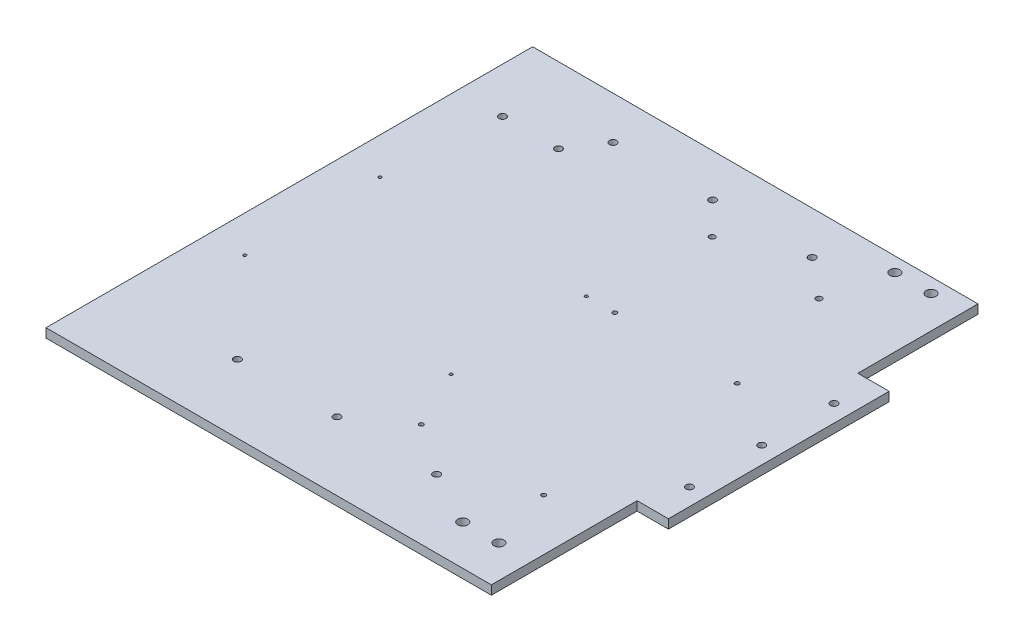
ISO-10303-21;
HEADER;
FILE_DESCRIPTION(('STEP AP214'),'2;1');
FILE_NAME('part.step','',(''),(''),'','','');
FILE_SCHEMA(('AUTOMOTIVE_DESIGN { 1 0 10303 214 1 1 1 1 }'));
ENDSEC;
DATA;
#1=APPLICATION_CONTEXT('core data for automotive mechanical design processes');
#2=APPLICATION_PROTOCOL_DEFINITION('international standard','automotive_design',2000,#1);
#3=PRODUCT_CONTEXT('',#1,'mechanical');
#4=PRODUCT('Part','Part','',(#3));
#5=PRODUCT_RELATED_PRODUCT_CATEGORY('part','',(#4));
#6=PRODUCT_DEFINITION_FORMATION('','',#4);
#7=PRODUCT_DEFINITION_CONTEXT('part definition',#1,'design');
#8=PRODUCT_DEFINITION('design','',#6,#7);
#9=PRODUCT_DEFINITION_SHAPE('','',#8);
#10=(LENGTH_UNIT() NAMED_UNIT(*) SI_UNIT(.MILLI.,.METRE.));
#11=(NAMED_UNIT(*) PLANE_ANGLE_UNIT() SI_UNIT($,.RADIAN.));
#12=(NAMED_UNIT(*) SI_UNIT($,.STERADIAN.) SOLID_ANGLE_UNIT());
#13=UNCERTAINTY_MEASURE_WITH_UNIT(LENGTH_MEASURE(1.E-05),#10,'distance_accuracy_value','');
#14=(GEOMETRIC_REPRESENTATION_CONTEXT(3) GLOBAL_UNCERTAINTY_ASSIGNED_CONTEXT((#13)) GLOBAL_UNIT_ASSIGNED_CONTEXT((#10,
#11,#12)) REPRESENTATION_CONTEXT('',''));
#15=CARTESIAN_POINT('',(0.,0.,0.));
#16=DIRECTION('',(0.,0.,1.));
#17=DIRECTION('',(1.,0.,0.));
#18=AXIS2_PLACEMENT_3D('',#15,#16,#17);
#19=CARTESIAN_POINT('',(156.499999999998,-6.35,171.));
#20=DIRECTION('',(1.,0.,0.));
#21=DIRECTION('',(0.,0.,-1.));
#22=AXIS2_PLACEMENT_3D('',#19,#20,#21);
#23=PLANE('',#22);
#24=DIRECTION('',(0.,0.,-1.));
#25=VECTOR('',#24,1.);
#26=CARTESIAN_POINT('',(156.499999999998,-6.35,171.));
#27=LINE('',#26,#25);
#28=CARTESIAN_POINT('',(156.499999999998,-6.35,171.));
#29=VERTEX_POINT('',#28);
#30=CARTESIAN_POINT('',(156.499999999998,-6.35,68.5702017650868));
#31=VERTEX_POINT('',#30);
#32=EDGE_CURVE('E148',#29,#31,#27,.T.);
#33=ORIENTED_EDGE('',*,*,#32,.T.);
#34=DIRECTION('',(0.,1.,0.));
#35=VECTOR('',#34,1.);
#36=CARTESIAN_POINT('',(156.499999999998,-6.35,68.5702017650868));
#37=LINE('',#36,#35);
#38=CARTESIAN_POINT('',(156.499999999998,0.,68.5702017650868));
#39=VERTEX_POINT('',#38);
#40=EDGE_CURVE('E130',#31,#39,#37,.T.);
#41=ORIENTED_EDGE('',*,*,#40,.T.);
#42=DIRECTION('',(0.,0.,-1.));
#43=VECTOR('',#42,1.);
#44=CARTESIAN_POINT('',(156.499999999998,0.,171.));
#45=LINE('',#44,#43);
#46=CARTESIAN_POINT('',(156.499999999998,0.,171.));
#47=VERTEX_POINT('',#46);
#48=EDGE_CURVE('E158',#47,#39,#45,.T.);
#49=ORIENTED_EDGE('',*,*,#48,.F.);
#50=DIRECTION('',(0.,1.,0.));
#51=VECTOR('',#50,1.);
#52=CARTESIAN_POINT('',(156.499999999998,-6.35,171.));
#53=LINE('',#52,#51);
#54=EDGE_CURVE('E11',#29,#47,#53,.T.);
#55=ORIENTED_EDGE('',*,*,#54,.F.);
#56=EDGE_LOOP('',(#33,#41,#49,#55));
#57=FACE_BOUND('',#56,.T.);
#58=ADVANCED_FACE('F37',(#57),#23,.T.);
#59=DIRECTION('',(0.,1.,0.));
#60=VECTOR('',#59,1.);
#61=CARTESIAN_POINT('',(156.499999999998,-6.35,-86.5702017646762));
#62=LINE('',#61,#60);
#63=CARTESIAN_POINT('',(156.499999999998,-6.35,-86.5702017646762));
#64=VERTEX_POINT('',#63);
#65=CARTESIAN_POINT('',(156.499999999998,0.,-86.5702017646762));
#66=VERTEX_POINT('',#65);
#67=EDGE_CURVE('E145',#64,#66,#62,.T.);
#68=ORIENTED_EDGE('',*,*,#67,.F.);
#69=CARTESIAN_POINT('',(156.499999999998,-6.35,-171.));
#70=VERTEX_POINT('',#69);
#71=EDGE_CURVE('E88',#64,#70,#27,.T.);
#72=ORIENTED_EDGE('',*,*,#71,.T.);
#73=DIRECTION('',(0.,1.,0.));
#74=VECTOR('',#73,1.);
#75=CARTESIAN_POINT('',(156.499999999998,-6.35,-171.));
#76=LINE('',#75,#74);
#77=CARTESIAN_POINT('',(156.499999999998,0.,-171.));
#78=VERTEX_POINT('',#77);
#79=EDGE_CURVE('E41',#70,#78,#76,.T.);
#80=ORIENTED_EDGE('',*,*,#79,.T.);
#81=EDGE_CURVE('E144',#66,#78,#45,.T.);
#82=ORIENTED_EDGE('',*,*,#81,.F.);
#83=EDGE_LOOP('',(#68,#72,#80,#82));
#84=FACE_BOUND('',#83,.T.);
#85=ADVANCED_FACE('F39',(#84),#23,.T.);
#86=CARTESIAN_POINT('',(-156.500000000002,-6.35,171.));
#87=DIRECTION('',(0.,0.,1.));
#88=DIRECTION('',(1.,0.,0.));
#89=AXIS2_PLACEMENT_3D('',#86,#87,#88);
#90=PLANE('',#89);
#91=DIRECTION('',(1.,0.,0.));
#92=VECTOR('',#91,1.);
#93=CARTESIAN_POINT('',(-156.500000000002,0.,171.));
#94=LINE('',#93,#92);
#95=CARTESIAN_POINT('',(-156.500000000002,0.,171.));
#96=VERTEX_POINT('',#95);
#97=EDGE_CURVE('E167',#96,#47,#94,.T.);
#98=ORIENTED_EDGE('',*,*,#97,.F.);
#99=DIRECTION('',(0.,1.,0.));
#100=VECTOR('',#99,1.);
#101=CARTESIAN_POINT('',(-156.500000000002,-6.35,171.));
#102=LINE('',#101,#100);
#103=CARTESIAN_POINT('',(-156.500000000002,-6.35,171.));
#104=VERTEX_POINT('',#103);
#105=EDGE_CURVE('E46',#104,#96,#102,.T.);
#106=ORIENTED_EDGE('',*,*,#105,.F.);
#107=DIRECTION('',(1.,0.,0.));
#108=VECTOR('',#107,1.);
#109=CARTESIAN_POINT('',(-156.500000000002,-6.35,171.));
#110=LINE('',#109,#108);
#111=EDGE_CURVE('E156',#104,#29,#110,.T.);
#112=ORIENTED_EDGE('',*,*,#111,.T.);
#113=ORIENTED_EDGE('',*,*,#54,.T.);
#114=EDGE_LOOP('',(#98,#106,#112,#113));
#115=FACE_BOUND('',#114,.T.);
#116=ADVANCED_FACE('F187',(#115),#90,.T.);
#117=CARTESIAN_POINT('',(-156.500000000002,-6.35,171.));
#118=DIRECTION('',(-1.,0.,0.));
#119=DIRECTION('',(0.,0.,1.));
#120=AXIS2_PLACEMENT_3D('',#117,#118,#119);
#121=PLANE('',#120);
#122=DIRECTION('',(0.,0.,1.));
#123=VECTOR('',#122,1.);
#124=CARTESIAN_POINT('',(-156.500000000002,0.,171.));
#125=LINE('',#124,#123);
#126=CARTESIAN_POINT('',(-156.500000000002,0.,-171.));
#127=VERTEX_POINT('',#126);
#128=EDGE_CURVE('E164',#127,#96,#125,.T.);
#129=ORIENTED_EDGE('',*,*,#128,.F.);
#130=DIRECTION('',(0.,1.,0.));
#131=VECTOR('',#130,1.);
#132=CARTESIAN_POINT('',(-156.500000000002,-6.35,-171.));
#133=LINE('',#132,#131);
#134=CARTESIAN_POINT('',(-156.500000000002,-6.35,-171.));
#135=VERTEX_POINT('',#134);
#136=EDGE_CURVE('E170',#135,#127,#133,.T.);
#137=ORIENTED_EDGE('',*,*,#136,.F.);
#138=DIRECTION('',(0.,0.,1.));
#139=VECTOR('',#138,1.);
#140=CARTESIAN_POINT('',(-156.500000000002,-6.35,171.));
#141=LINE('',#140,#139);
#142=EDGE_CURVE('E153',#135,#104,#141,.T.);
#143=ORIENTED_EDGE('',*,*,#142,.T.);
#144=ORIENTED_EDGE('',*,*,#105,.T.);
#145=EDGE_LOOP('',(#129,#137,#143,#144));
#146=FACE_BOUND('',#145,.T.);
#147=ADVANCED_FACE('F186',(#146),#121,.T.);
#148=CARTESIAN_POINT('',(-156.500000000002,-6.35,-171.));
#149=DIRECTION('',(0.,0.,-1.));
#150=DIRECTION('',(-1.,0.,0.));
#151=AXIS2_PLACEMENT_3D('',#148,#149,#150);
#152=PLANE('',#151);
#153=DIRECTION('',(-1.,0.,0.));
#154=VECTOR('',#153,1.);
#155=CARTESIAN_POINT('',(-156.500000000002,0.,-171.));
#156=LINE('',#155,#154);
#157=EDGE_CURVE('E161',#78,#127,#156,.T.);
#158=ORIENTED_EDGE('',*,*,#157,.F.);
#159=ORIENTED_EDGE('',*,*,#79,.F.);
#160=DIRECTION('',(-1.,0.,0.));
#161=VECTOR('',#160,1.);
#162=CARTESIAN_POINT('',(-156.500000000002,-6.35,-171.));
#163=LINE('',#162,#161);
#164=EDGE_CURVE('E150',#70,#135,#163,.T.);
#165=ORIENTED_EDGE('',*,*,#164,.T.);
#166=ORIENTED_EDGE('',*,*,#136,.T.);
#167=EDGE_LOOP('',(#158,#159,#165,#166));
#168=FACE_BOUND('',#167,.T.);
#169=ADVANCED_FACE('F176',(#168),#152,.T.);
#170=CARTESIAN_POINT('',(0.,-6.35,0.));
#171=DIRECTION('',(0.,-1.,0.));
#172=DIRECTION('',(0.,0.,-1.));
#173=AXIS2_PLACEMENT_3D('',#170,#171,#172);
#174=PLANE('',#173);
#175=CARTESIAN_POINT('',(120.259039894425,-6.35000000000026,-37.9813277812933));
#176=DIRECTION('',(0.,1.,0.));
#177=DIRECTION('',(0.,0.,1.));
#178=AXIS2_PLACEMENT_3D('',#175,#176,#177);
#179=CIRCLE('',#178,1.50000000000009);
#180=CARTESIAN_POINT('',(120.259039894425,-6.35000000000026,-36.4813277812932));
#181=VERTEX_POINT('',#180);
#182=EDGE_CURVE('E361',#181,#181,#179,.T.);
#183=ORIENTED_EDGE('',*,*,#182,.T.);
#184=EDGE_LOOP('',(#183));
#185=FACE_BOUND('',#184,.T.);
#186=CARTESIAN_POINT('',(14.2590398944238,-6.35000000000026,57.018672218706));
#187=DIRECTION('',(0.,1.,0.));
#188=DIRECTION('',(0.,0.,1.));
#189=AXIS2_PLACEMENT_3D('',#186,#187,#188);
#190=CIRCLE('',#189,1.05000000000002);
#191=CARTESIAN_POINT('',(14.2590398944238,-6.35000000000026,58.068672218706));
#192=VERTEX_POINT('',#191);
#193=EDGE_CURVE('E348',#192,#192,#190,.T.);
#194=ORIENTED_EDGE('',*,*,#193,.T.);
#195=EDGE_LOOP('',(#194));
#196=FACE_BOUND('',#195,.T.);
#197=CARTESIAN_POINT('',(-130.740960105576,-6.35000000000026,57.0186722187049));
#198=DIRECTION('',(0.,1.,0.));
#199=DIRECTION('',(0.,0.,1.));
#200=AXIS2_PLACEMENT_3D('',#197,#198,#199);
#201=CIRCLE('',#200,1.04999999999979);
#202=CARTESIAN_POINT('',(-130.740960105576,-6.35000000000026,58.0686722187047));
#203=VERTEX_POINT('',#202);
#204=EDGE_CURVE('E349',#203,#203,#201,.T.);
#205=ORIENTED_EDGE('',*,*,#204,.T.);
#206=EDGE_LOOP('',(#205));
#207=FACE_BOUND('',#206,.T.);
#208=CARTESIAN_POINT('',(14.2590398944244,-6.35000000000026,-37.9813277812941));
#209=DIRECTION('',(0.,1.,0.));
#210=DIRECTION('',(0.,0.,1.));
#211=AXIS2_PLACEMENT_3D('',#208,#209,#210);
#212=CIRCLE('',#211,1.05000000000019);
#213=CARTESIAN_POINT('',(14.2590398944244,-6.35000000000026,-36.9313277812939));
#214=VERTEX_POINT('',#213);
#215=EDGE_CURVE('E339',#214,#214,#212,.T.);
#216=ORIENTED_EDGE('',*,*,#215,.T.);
#217=EDGE_LOOP('',(#216));
#218=FACE_BOUND('',#217,.T.);
#219=CARTESIAN_POINT('',(22.3342893104482,-6.35000000000026,-118.365529646909));
#220=DIRECTION('',(0.,1.,0.));
#221=DIRECTION('',(0.,0.,1.));
#222=AXIS2_PLACEMENT_3D('',#219,#220,#221);
#223=CIRCLE('',#222,1.99999999999977);
#224=CARTESIAN_POINT('',(22.3342893104482,-6.35000000000026,-116.365529646909));
#225=VERTEX_POINT('',#224);
#226=EDGE_CURVE('E384',#225,#225,#223,.T.);
#227=ORIENTED_EDGE('',*,*,#226,.T.);
#228=EDGE_LOOP('',(#227));
#229=FACE_BOUND('',#228,.T.);
#230=CARTESIAN_POINT('',(120.259039894424,-6.35000000000026,98.0186722187066));
#231=DIRECTION('',(0.,1.,0.));
#232=DIRECTION('',(0.,0.,1.));
#233=AXIS2_PLACEMENT_3D('',#230,#231,#232);
#234=CIRCLE('',#233,1.50000000000009);
#235=CARTESIAN_POINT('',(120.259039894424,-6.35000000000026,99.5186722187067));
#236=VERTEX_POINT('',#235);
#237=EDGE_CURVE('E371',#236,#236,#234,.T.);
#238=ORIENTED_EDGE('',*,*,#237,.T.);
#239=EDGE_LOOP('',(#238));
#240=FACE_BOUND('',#239,.T.);
#241=CARTESIAN_POINT('',(34.2590398944235,-6.35000000000026,98.018672218706));
#242=DIRECTION('',(0.,1.,0.));
#243=DIRECTION('',(0.,0.,1.));
#244=AXIS2_PLACEMENT_3D('',#241,#242,#243);
#245=CIRCLE('',#244,1.49999999999985);
#246=CARTESIAN_POINT('',(34.2590398944235,-6.35000000000026,99.5186722187059));
#247=VERTEX_POINT('',#246);
#248=EDGE_CURVE('E372',#247,#247,#245,.T.);
#249=ORIENTED_EDGE('',*,*,#248,.T.);
#250=EDGE_LOOP('',(#249));
#251=FACE_BOUND('',#250,.T.);
#252=CARTESIAN_POINT('',(34.2590398944244,-6.35000000000026,-37.9813277812939));
#253=DIRECTION('',(0.,1.,0.));
#254=DIRECTION('',(0.,0.,1.));
#255=AXIS2_PLACEMENT_3D('',#252,#253,#254);
#256=CIRCLE('',#255,1.49999999999985);
#257=CARTESIAN_POINT('',(34.2590398944244,-6.35000000000026,-36.4813277812941));
#258=VERTEX_POINT('',#257);
#259=EDGE_CURVE('E360',#258,#258,#256,.T.);
#260=ORIENTED_EDGE('',*,*,#259,.T.);
#261=EDGE_LOOP('',(#260));
#262=FACE_BOUND('',#261,.T.);
#263=CARTESIAN_POINT('',(-124.665710689552,-6.35000000000026,-117.980264566603));
#264=DIRECTION('',(0.,1.,0.));
#265=DIRECTION('',(0.,0.,1.));
#266=AXIS2_PLACEMENT_3D('',#263,#264,#265);
#267=CIRCLE('',#266,2.49999999999997);
#268=CARTESIAN_POINT('',(-124.665710689552,-6.35000000000026,-115.480264566603));
#269=VERTEX_POINT('',#268);
#270=EDGE_CURVE('E324',#269,#269,#267,.T.);
#271=ORIENTED_EDGE('',*,*,#270,.T.);
#272=EDGE_LOOP('',(#271));
#273=FACE_BOUND('',#272,.T.);
#274=CARTESIAN_POINT('',(-85.3157106895518,-6.35000000000026,-117.980264566603));
#275=DIRECTION('',(0.,1.,0.));
#276=DIRECTION('',(0.,0.,1.));
#277=AXIS2_PLACEMENT_3D('',#274,#275,#276);
#278=CIRCLE('',#277,2.49999999999997);
#279=CARTESIAN_POINT('',(-85.3157106895518,-6.35000000000026,-115.480264566603));
#280=VERTEX_POINT('',#279);
#281=EDGE_CURVE('E329',#280,#280,#278,.T.);
#282=ORIENTED_EDGE('',*,*,#281,.T.);
#283=EDGE_LOOP('',(#282));
#284=FACE_BOUND('',#283,.T.);
#285=CARTESIAN_POINT('',(-130.740960105576,-6.35000000000026,-37.981327781295));
#286=DIRECTION('',(0.,1.,0.));
#287=DIRECTION('',(0.,0.,1.));
#288=AXIS2_PLACEMENT_3D('',#285,#286,#287);
#289=CIRCLE('',#288,1.05000000000003);
#290=CARTESIAN_POINT('',(-130.740960105576,-6.35000000000026,-36.931327781295));
#291=VERTEX_POINT('',#290);
#292=EDGE_CURVE('E340',#291,#291,#289,.T.);
#293=ORIENTED_EDGE('',*,*,#292,.T.);
#294=EDGE_LOOP('',(#293));
#295=FACE_BOUND('',#294,.T.);
#296=CARTESIAN_POINT('',(97.3856259877608,-6.35000000000026,-118.365529646908));
#297=DIRECTION('',(0.,1.,0.));
#298=DIRECTION('',(0.,0.,1.));
#299=AXIS2_PLACEMENT_3D('',#296,#297,#298);
#300=CIRCLE('',#299,2.);
#301=CARTESIAN_POINT('',(97.3856259877608,-6.35000000000026,-116.365529646908));
#302=VERTEX_POINT('',#301);
#303=EDGE_CURVE('E392',#302,#302,#300,.T.);
#304=ORIENTED_EDGE('',*,*,#303,.T.);
#305=EDGE_LOOP('',(#304));
#306=FACE_BOUND('',#305,.T.);
#307=CARTESIAN_POINT('',(133.639999999999,-6.35000000000039,-160.83999999959));
#308=DIRECTION('',(0.,-1.,0.));
#309=DIRECTION('',(0.,0.,-1.));
#310=AXIS2_PLACEMENT_3D('',#307,#308,#309);
#311=CIRCLE('',#310,3.49999999999999);
#312=CARTESIAN_POINT('',(133.639999999999,-6.35000000000026,-164.33999999959));
#313=VERTEX_POINT('',#312);
#314=EDGE_CURVE('E398',#313,#313,#311,.T.);
#315=ORIENTED_EDGE('',*,*,#314,.F.);
#316=EDGE_LOOP('',(#315));
#317=FACE_BOUND('',#316,.T.);
#318=CARTESIAN_POINT('',(108.239999999999,-6.35000000000039,-160.83999999959));
#319=DIRECTION('',(0.,-1.,0.));
#320=DIRECTION('',(0.,0.,-1.));
#321=AXIS2_PLACEMENT_3D('',#318,#319,#320);
#322=CIRCLE('',#321,3.50000000000001);
#323=CARTESIAN_POINT('',(108.239999999999,-6.35000000000026,-164.33999999959));
#324=VERTEX_POINT('',#323);
#325=EDGE_CURVE('E405',#324,#324,#322,.T.);
#326=ORIENTED_EDGE('',*,*,#325,.F.);
#327=EDGE_LOOP('',(#326));
#328=FACE_BOUND('',#327,.T.);
#329=CARTESIAN_POINT('',(133.639999999998,-6.35,142.84));
#330=DIRECTION('',(0.,1.,0.));
#331=DIRECTION('',(0.,0.,1.));
#332=AXIS2_PLACEMENT_3D('',#329,#330,#331);
#333=CIRCLE('',#332,3.49999999999999);
#334=CARTESIAN_POINT('',(133.639999999998,-6.35,146.34));
#335=VERTEX_POINT('',#334);
#336=EDGE_CURVE('E410',#335,#335,#333,.T.);
#337=ORIENTED_EDGE('',*,*,#336,.T.);
#338=EDGE_LOOP('',(#337));
#339=FACE_BOUND('',#338,.T.);
#340=CARTESIAN_POINT('',(108.239999999998,-6.35,142.84));
#341=DIRECTION('',(0.,1.,0.));
#342=DIRECTION('',(0.,0.,1.));
#343=AXIS2_PLACEMENT_3D('',#340,#341,#342);
#344=CIRCLE('',#343,3.50000000000001);
#345=CARTESIAN_POINT('',(108.239999999998,-6.35,146.34));
#346=VERTEX_POINT('',#345);
#347=EDGE_CURVE('E401',#346,#346,#344,.T.);
#348=ORIENTED_EDGE('',*,*,#347,.T.);
#349=EDGE_LOOP('',(#348));
#350=FACE_BOUND('',#349,.T.);
#351=CARTESIAN_POINT('',(-70.,-6.35,123.000000000205));
#352=DIRECTION('',(0.,1.,0.));
#353=DIRECTION('',(0.,0.,1.));
#354=AXIS2_PLACEMENT_3D('',#351,#352,#353);
#355=CIRCLE('',#354,2.50000000006091);
#356=CARTESIAN_POINT('',(-70.,-6.35,125.500000000266));
#357=VERTEX_POINT('',#356);
#358=EDGE_CURVE('E432',#357,#357,#355,.T.);
#359=ORIENTED_EDGE('',*,*,#358,.T.);
#360=EDGE_LOOP('',(#359));
#361=FACE_BOUND('',#360,.T.);
#362=CARTESIAN_POINT('',(70.,-6.35,123.000000000205));
#363=DIRECTION('',(0.,1.,0.));
#364=DIRECTION('',(0.,0.,-1.));
#365=AXIS2_PLACEMENT_3D('',#362,#363,#364);
#366=CIRCLE('',#365,2.50000000006091);
#367=CARTESIAN_POINT('',(70.,-6.35,120.500000000144));
#368=VERTEX_POINT('',#367);
#369=EDGE_CURVE('E438',#368,#368,#366,.T.);
#370=ORIENTED_EDGE('',*,*,#369,.T.);
#371=EDGE_LOOP('',(#370));
#372=FACE_BOUND('',#371,.T.);
#373=CARTESIAN_POINT('',(-70.,-6.35,-140.999999999795));
#374=DIRECTION('',(0.,1.,0.));
#375=DIRECTION('',(0.,0.,-1.));
#376=AXIS2_PLACEMENT_3D('',#373,#374,#375);
#377=CIRCLE('',#376,2.50000000006092);
#378=CARTESIAN_POINT('',(-70.,-6.35,-143.499999999856));
#379=VERTEX_POINT('',#378);
#380=EDGE_CURVE('E444',#379,#379,#377,.T.);
#381=ORIENTED_EDGE('',*,*,#380,.T.);
#382=EDGE_LOOP('',(#381));
#383=FACE_BOUND('',#382,.T.);
#384=CARTESIAN_POINT('',(0.,-6.35,-140.999999999795));
#385=DIRECTION('',(0.,1.,0.));
#386=DIRECTION('',(0.,0.,-1.));
#387=AXIS2_PLACEMENT_3D('',#384,#385,#386);
#388=CIRCLE('',#387,2.50000000006095);
#389=CARTESIAN_POINT('',(0.,-6.35,-143.499999999856));
#390=VERTEX_POINT('',#389);
#391=EDGE_CURVE('E425',#390,#390,#388,.T.);
#392=ORIENTED_EDGE('',*,*,#391,.T.);
#393=EDGE_LOOP('',(#392));
#394=FACE_BOUND('',#393,.T.);
#395=CARTESIAN_POINT('',(70.,-6.35,-140.999999999795));
#396=DIRECTION('',(0.,1.,0.));
#397=DIRECTION('',(0.,0.,1.));
#398=AXIS2_PLACEMENT_3D('',#395,#396,#397);
#399=CIRCLE('',#398,2.50000000006093);
#400=CARTESIAN_POINT('',(70.,-6.35,-138.499999999734));
#401=VERTEX_POINT('',#400);
#402=EDGE_CURVE('E413',#401,#401,#399,.T.);
#403=ORIENTED_EDGE('',*,*,#402,.T.);
#404=EDGE_LOOP('',(#403));
#405=FACE_BOUND('',#404,.T.);
#406=CARTESIAN_POINT('',(0.,-6.35,123.000000000205));
#407=DIRECTION('',(0.,1.,0.));
#408=DIRECTION('',(0.,0.,1.));
#409=AXIS2_PLACEMENT_3D('',#406,#407,#408);
#410=CIRCLE('',#409,2.50000000006092);
#411=CARTESIAN_POINT('',(0.,-6.35,125.500000000266));
#412=VERTEX_POINT('',#411);
#413=EDGE_CURVE('E452',#412,#412,#410,.T.);
#414=ORIENTED_EDGE('',*,*,#413,.T.);
#415=EDGE_LOOP('',(#414));
#416=FACE_BOUND('',#415,.T.);
#417=ORIENTED_EDGE('',*,*,#32,.F.);
#418=ORIENTED_EDGE('',*,*,#111,.F.);
#419=ORIENTED_EDGE('',*,*,#142,.F.);
#420=ORIENTED_EDGE('',*,*,#164,.F.);
#421=ORIENTED_EDGE('',*,*,#71,.F.);
#422=DIRECTION('',(-1.,0.,0.));
#423=VECTOR('',#422,1.);
#424=CARTESIAN_POINT('',(178.499999999998,-6.35,-86.5702017646762));
#425=LINE('',#424,#423);
#426=CARTESIAN_POINT('',(178.499999999998,-6.35,-86.5702017646762));
#427=VERTEX_POINT('',#426);
#428=EDGE_CURVE('E120',#427,#64,#425,.T.);
#429=ORIENTED_EDGE('',*,*,#428,.F.);
#430=DIRECTION('',(0.,0.,-1.));
#431=VECTOR('',#430,1.);
#432=CARTESIAN_POINT('',(178.499999999998,-6.35,68.5702017650868));
#433=LINE('',#432,#431);
#434=CARTESIAN_POINT('',(178.499999999998,-6.35,68.5702017650868));
#435=VERTEX_POINT('',#434);
#436=EDGE_CURVE('E115',#435,#427,#433,.T.);
#437=ORIENTED_EDGE('',*,*,#436,.F.);
#438=DIRECTION('',(1.,0.,0.));
#439=VECTOR('',#438,1.);
#440=CARTESIAN_POINT('',(156.499999999998,-6.35,68.5702017650868));
#441=LINE('',#440,#439);
#442=EDGE_CURVE('E127',#31,#435,#441,.T.);
#443=ORIENTED_EDGE('',*,*,#442,.F.);
#444=EDGE_LOOP('',(#417,#418,#419,#420,#421,#429,#437,#443));
#445=FACE_BOUND('',#444,.T.);
#446=CARTESIAN_POINT('',(166.499999999998,-6.35,-59.7999999997947));
#447=DIRECTION('',(0.,1.,0.));
#448=DIRECTION('',(0.,0.,-1.));
#449=AXIS2_PLACEMENT_3D('',#446,#447,#448);
#450=CIRCLE('',#449,2.50000000006092);
#451=CARTESIAN_POINT('',(166.499999999998,-6.35,-62.2999999998556));
#452=VERTEX_POINT('',#451);
#453=EDGE_CURVE('E458',#452,#452,#450,.T.);
#454=ORIENTED_EDGE('',*,*,#453,.T.);
#455=EDGE_LOOP('',(#454));
#456=FACE_BOUND('',#455,.T.);
#457=CARTESIAN_POINT('',(166.499999999998,-6.35,41.8000000002053));
#458=DIRECTION('',(0.,1.,0.));
#459=DIRECTION('',(0.,0.,1.));
#460=AXIS2_PLACEMENT_3D('',#457,#458,#459);
#461=CIRCLE('',#460,2.50000000006092);
#462=CARTESIAN_POINT('',(166.499999999998,-6.35,44.3000000002662));
#463=VERTEX_POINT('',#462);
#464=EDGE_CURVE('E464',#463,#463,#461,.T.);
#465=ORIENTED_EDGE('',*,*,#464,.T.);
#466=EDGE_LOOP('',(#465));
#467=FACE_BOUND('',#466,.T.);
#468=CARTESIAN_POINT('',(166.499999999998,-6.35,-8.9999999997947));
#469=DIRECTION('',(0.,1.,0.));
#470=DIRECTION('',(0.,0.,1.));
#471=AXIS2_PLACEMENT_3D('',#468,#469,#470);
#472=CIRCLE('',#471,2.50000000006092);
#473=CARTESIAN_POINT('',(166.499999999998,-6.35,-6.49999999973378));
#474=VERTEX_POINT('',#473);
#475=EDGE_CURVE('E141',#474,#474,#472,.T.);
#476=ORIENTED_EDGE('',*,*,#475,.T.);
#477=EDGE_LOOP('',(#476));
#478=FACE_BOUND('',#477,.T.);
#479=ADVANCED_FACE('F125',(#185,#196,#207,#218,#229,#240,#251,#262,#273,#284,#295,#306,#317,
#328,#339,#350,#361,#372,#383,#394,#405,#416,#445,#456,#467,#478),#174,.T.);
#480=CARTESIAN_POINT('',(0.,0.,0.));
#481=DIRECTION('',(0.,-1.,0.));
#482=DIRECTION('',(0.,0.,-1.));
#483=AXIS2_PLACEMENT_3D('',#480,#481,#482);
#484=PLANE('',#483);
#485=CARTESIAN_POINT('',(120.259039894425,0.,-37.9813277812933));
#486=DIRECTION('',(0.,1.,0.));
#487=DIRECTION('',(0.,0.,1.));
#488=AXIS2_PLACEMENT_3D('',#485,#486,#487);
#489=CIRCLE('',#488,1.50000000000009);
#490=CARTESIAN_POINT('',(120.259039894425,0.,-36.4813277812932));
#491=VERTEX_POINT('',#490);
#492=EDGE_CURVE('E357',#491,#491,#489,.T.);
#493=ORIENTED_EDGE('',*,*,#492,.F.);
#494=EDGE_LOOP('',(#493));
#495=FACE_BOUND('',#494,.T.);
#496=CARTESIAN_POINT('',(14.2590398944238,0.,57.018672218706));
#497=DIRECTION('',(0.,1.,0.));
#498=DIRECTION('',(0.,0.,1.));
#499=AXIS2_PLACEMENT_3D('',#496,#497,#498);
#500=CIRCLE('',#499,1.05000000000002);
#501=CARTESIAN_POINT('',(14.2590398944238,0.,58.068672218706));
#502=VERTEX_POINT('',#501);
#503=EDGE_CURVE('E363',#502,#502,#500,.T.);
#504=ORIENTED_EDGE('',*,*,#503,.F.);
#505=EDGE_LOOP('',(#504));
#506=FACE_BOUND('',#505,.T.);
#507=CARTESIAN_POINT('',(-130.740960105576,0.,57.0186722187049));
#508=DIRECTION('',(0.,1.,0.));
#509=DIRECTION('',(0.,0.,1.));
#510=AXIS2_PLACEMENT_3D('',#507,#508,#509);
#511=CIRCLE('',#510,1.04999999999979);
#512=CARTESIAN_POINT('',(-130.740960105576,0.,58.0686722187047));
#513=VERTEX_POINT('',#512);
#514=EDGE_CURVE('E345',#513,#513,#511,.T.);
#515=ORIENTED_EDGE('',*,*,#514,.F.);
#516=EDGE_LOOP('',(#515));
#517=FACE_BOUND('',#516,.T.);
#518=CARTESIAN_POINT('',(14.2590398944244,0.,-37.9813277812941));
#519=DIRECTION('',(0.,1.,0.));
#520=DIRECTION('',(0.,0.,1.));
#521=AXIS2_PLACEMENT_3D('',#518,#519,#520);
#522=CIRCLE('',#521,1.05000000000019);
#523=CARTESIAN_POINT('',(14.2590398944244,0.,-36.9313277812939));
#524=VERTEX_POINT('',#523);
#525=EDGE_CURVE('E352',#524,#524,#522,.T.);
#526=ORIENTED_EDGE('',*,*,#525,.F.);
#527=EDGE_LOOP('',(#526));
#528=FACE_BOUND('',#527,.T.);
#529=CARTESIAN_POINT('',(22.3342893104482,0.,-118.365529646909));
#530=DIRECTION('',(0.,1.,0.));
#531=DIRECTION('',(0.,0.,1.));
#532=AXIS2_PLACEMENT_3D('',#529,#530,#531);
#533=CIRCLE('',#532,1.99999999999977);
#534=CARTESIAN_POINT('',(22.3342893104482,0.,-116.365529646909));
#535=VERTEX_POINT('',#534);
#536=EDGE_CURVE('E380',#535,#535,#533,.T.);
#537=ORIENTED_EDGE('',*,*,#536,.F.);
#538=EDGE_LOOP('',(#537));
#539=FACE_BOUND('',#538,.T.);
#540=CARTESIAN_POINT('',(120.259039894424,0.,98.0186722187066));
#541=DIRECTION('',(0.,1.,0.));
#542=DIRECTION('',(0.,0.,1.));
#543=AXIS2_PLACEMENT_3D('',#540,#541,#542);
#544=CIRCLE('',#543,1.50000000000009);
#545=CARTESIAN_POINT('',(120.259039894424,0.,99.5186722187067));
#546=VERTEX_POINT('',#545);
#547=EDGE_CURVE('E387',#546,#546,#544,.T.);
#548=ORIENTED_EDGE('',*,*,#547,.F.);
#549=EDGE_LOOP('',(#548));
#550=FACE_BOUND('',#549,.T.);
#551=CARTESIAN_POINT('',(34.2590398944235,0.,98.018672218706));
#552=DIRECTION('',(0.,1.,0.));
#553=DIRECTION('',(0.,0.,1.));
#554=AXIS2_PLACEMENT_3D('',#551,#552,#553);
#555=CIRCLE('',#554,1.49999999999985);
#556=CARTESIAN_POINT('',(34.2590398944235,0.,99.5186722187059));
#557=VERTEX_POINT('',#556);
#558=EDGE_CURVE('E368',#557,#557,#555,.T.);
#559=ORIENTED_EDGE('',*,*,#558,.F.);
#560=EDGE_LOOP('',(#559));
#561=FACE_BOUND('',#560,.T.);
#562=CARTESIAN_POINT('',(34.2590398944244,0.,-37.9813277812939));
#563=DIRECTION('',(0.,1.,0.));
#564=DIRECTION('',(0.,0.,1.));
#565=AXIS2_PLACEMENT_3D('',#562,#563,#564);
#566=CIRCLE('',#565,1.49999999999985);
#567=CARTESIAN_POINT('',(34.2590398944244,0.,-36.4813277812941));
#568=VERTEX_POINT('',#567);
#569=EDGE_CURVE('E375',#568,#568,#566,.T.);
#570=ORIENTED_EDGE('',*,*,#569,.F.);
#571=EDGE_LOOP('',(#570));
#572=FACE_BOUND('',#571,.T.);
#573=CARTESIAN_POINT('',(-124.665710689552,0.,-117.980264566603));
#574=DIRECTION('',(0.,1.,0.));
#575=DIRECTION('',(0.,0.,1.));
#576=AXIS2_PLACEMENT_3D('',#573,#574,#575);
#577=CIRCLE('',#576,2.49999999999997);
#578=CARTESIAN_POINT('',(-124.665710689552,0.,-115.480264566603));
#579=VERTEX_POINT('',#578);
#580=EDGE_CURVE('E327',#579,#579,#577,.T.);
#581=ORIENTED_EDGE('',*,*,#580,.F.);
#582=EDGE_LOOP('',(#581));
#583=FACE_BOUND('',#582,.T.);
#584=CARTESIAN_POINT('',(-85.3157106895518,0.,-117.980264566603));
#585=DIRECTION('',(0.,1.,0.));
#586=DIRECTION('',(0.,0.,1.));
#587=AXIS2_PLACEMENT_3D('',#584,#585,#586);
#588=CIRCLE('',#587,2.49999999999997);
#589=CARTESIAN_POINT('',(-85.3157106895518,0.,-115.480264566603));
#590=VERTEX_POINT('',#589);
#591=EDGE_CURVE('E332',#590,#590,#588,.T.);
#592=ORIENTED_EDGE('',*,*,#591,.F.);
#593=EDGE_LOOP('',(#592));
#594=FACE_BOUND('',#593,.T.);
#595=CARTESIAN_POINT('',(-130.740960105576,0.,-37.981327781295));
#596=DIRECTION('',(0.,1.,0.));
#597=DIRECTION('',(0.,0.,1.));
#598=AXIS2_PLACEMENT_3D('',#595,#596,#597);
#599=CIRCLE('',#598,1.05000000000003);
#600=CARTESIAN_POINT('',(-130.740960105576,0.,-36.931327781295));
#601=VERTEX_POINT('',#600);
#602=EDGE_CURVE('E336',#601,#601,#599,.T.);
#603=ORIENTED_EDGE('',*,*,#602,.F.);
#604=EDGE_LOOP('',(#603));
#605=FACE_BOUND('',#604,.T.);
#606=CARTESIAN_POINT('',(97.3856259877608,0.,-118.365529646908));
#607=DIRECTION('',(0.,1.,0.));
#608=DIRECTION('',(0.,0.,1.));
#609=AXIS2_PLACEMENT_3D('',#606,#607,#608);
#610=CIRCLE('',#609,2.);
#611=CARTESIAN_POINT('',(97.3856259877608,0.,-116.365529646908));
#612=VERTEX_POINT('',#611);
#613=EDGE_CURVE('E383',#612,#612,#610,.T.);
#614=ORIENTED_EDGE('',*,*,#613,.F.);
#615=EDGE_LOOP('',(#614));
#616=FACE_BOUND('',#615,.T.);
#617=CARTESIAN_POINT('',(133.639999999999,5.83162409270668E-12,-160.839999999589));
#618=DIRECTION('',(0.,-1.,0.));
#619=DIRECTION('',(0.,0.,-1.));
#620=AXIS2_PLACEMENT_3D('',#617,#618,#619);
#621=CIRCLE('',#620,3.49999999999999);
#622=CARTESIAN_POINT('',(133.639999999999,5.96604640780482E-12,-164.339999999589));
#623=VERTEX_POINT('',#622);
#624=EDGE_CURVE('E402',#623,#623,#621,.T.);
#625=ORIENTED_EDGE('',*,*,#624,.T.);
#626=EDGE_LOOP('',(#625));
#627=FACE_BOUND('',#626,.T.);
#628=CARTESIAN_POINT('',(108.239999999999,5.83162409270668E-12,-160.839999999589));
#629=DIRECTION('',(0.,-1.,0.));
#630=DIRECTION('',(0.,0.,-1.));
#631=AXIS2_PLACEMENT_3D('',#628,#629,#630);
#632=CIRCLE('',#631,3.50000000000001);
#633=CARTESIAN_POINT('',(108.239999999999,5.96604640780482E-12,-164.339999999589));
#634=VERTEX_POINT('',#633);
#635=EDGE_CURVE('E395',#634,#634,#632,.T.);
#636=ORIENTED_EDGE('',*,*,#635,.T.);
#637=EDGE_LOOP('',(#636));
#638=FACE_BOUND('',#637,.T.);
#639=CARTESIAN_POINT('',(133.639999999998,0.,142.84));
#640=DIRECTION('',(0.,1.,0.));
#641=DIRECTION('',(0.,0.,1.));
#642=AXIS2_PLACEMENT_3D('',#639,#640,#641);
#643=CIRCLE('',#642,3.49999999999999);
#644=CARTESIAN_POINT('',(133.639999999998,0.,146.34));
#645=VERTEX_POINT('',#644);
#646=EDGE_CURVE('E414',#645,#645,#643,.T.);
#647=ORIENTED_EDGE('',*,*,#646,.F.);
#648=EDGE_LOOP('',(#647));
#649=FACE_BOUND('',#648,.T.);
#650=CARTESIAN_POINT('',(108.239999999998,0.,142.84));
#651=DIRECTION('',(0.,1.,0.));
#652=DIRECTION('',(0.,0.,1.));
#653=AXIS2_PLACEMENT_3D('',#650,#651,#652);
#654=CIRCLE('',#653,3.50000000000001);
#655=CARTESIAN_POINT('',(108.239999999998,0.,146.34));
#656=VERTEX_POINT('',#655);
#657=EDGE_CURVE('E417',#656,#656,#654,.T.);
#658=ORIENTED_EDGE('',*,*,#657,.F.);
#659=EDGE_LOOP('',(#658));
#660=FACE_BOUND('',#659,.T.);
#661=CARTESIAN_POINT('',(-70.,0.,123.000000000205));
#662=DIRECTION('',(0.,1.,0.));
#663=DIRECTION('',(0.,0.,1.));
#664=AXIS2_PLACEMENT_3D('',#661,#662,#663);
#665=CIRCLE('',#664,2.50000000006091);
#666=CARTESIAN_POINT('',(-70.,0.,125.500000000266));
#667=VERTEX_POINT('',#666);
#668=EDGE_CURVE('E428',#667,#667,#665,.T.);
#669=ORIENTED_EDGE('',*,*,#668,.F.);
#670=EDGE_LOOP('',(#669));
#671=FACE_BOUND('',#670,.T.);
#672=CARTESIAN_POINT('',(70.,0.,123.000000000205));
#673=DIRECTION('',(0.,1.,0.));
#674=DIRECTION('',(0.,0.,-1.));
#675=AXIS2_PLACEMENT_3D('',#672,#673,#674);
#676=CIRCLE('',#675,2.50000000006091);
#677=CARTESIAN_POINT('',(70.,0.,120.500000000144));
#678=VERTEX_POINT('',#677);
#679=EDGE_CURVE('E435',#678,#678,#676,.T.);
#680=ORIENTED_EDGE('',*,*,#679,.F.);
#681=EDGE_LOOP('',(#680));
#682=FACE_BOUND('',#681,.T.);
#683=CARTESIAN_POINT('',(-70.,0.,-140.999999999795));
#684=DIRECTION('',(0.,1.,0.));
#685=DIRECTION('',(0.,0.,-1.));
#686=AXIS2_PLACEMENT_3D('',#683,#684,#685);
#687=CIRCLE('',#686,2.50000000006092);
#688=CARTESIAN_POINT('',(-70.,0.,-143.499999999856));
#689=VERTEX_POINT('',#688);
#690=EDGE_CURVE('E441',#689,#689,#687,.T.);
#691=ORIENTED_EDGE('',*,*,#690,.F.);
#692=EDGE_LOOP('',(#691));
#693=FACE_BOUND('',#692,.T.);
#694=CARTESIAN_POINT('',(0.,0.,-140.999999999795));
#695=DIRECTION('',(0.,1.,0.));
#696=DIRECTION('',(0.,0.,-1.));
#697=AXIS2_PLACEMENT_3D('',#694,#695,#696);
#698=CIRCLE('',#697,2.50000000006095);
#699=CARTESIAN_POINT('',(0.,0.,-143.499999999856));
#700=VERTEX_POINT('',#699);
#701=EDGE_CURVE('E447',#700,#700,#698,.T.);
#702=ORIENTED_EDGE('',*,*,#701,.F.);
#703=EDGE_LOOP('',(#702));
#704=FACE_BOUND('',#703,.T.);
#705=CARTESIAN_POINT('',(70.,0.,-140.999999999795));
#706=DIRECTION('',(0.,1.,0.));
#707=DIRECTION('',(0.,0.,1.));
#708=AXIS2_PLACEMENT_3D('',#705,#706,#707);
#709=CIRCLE('',#708,2.50000000006093);
#710=CARTESIAN_POINT('',(70.,0.,-138.499999999734));
#711=VERTEX_POINT('',#710);
#712=EDGE_CURVE('E422',#711,#711,#709,.T.);
#713=ORIENTED_EDGE('',*,*,#712,.F.);
#714=EDGE_LOOP('',(#713));
#715=FACE_BOUND('',#714,.T.);
#716=CARTESIAN_POINT('',(0.,0.,123.000000000205));
#717=DIRECTION('',(0.,1.,0.));
#718=DIRECTION('',(0.,0.,1.));
#719=AXIS2_PLACEMENT_3D('',#716,#717,#718);
#720=CIRCLE('',#719,2.50000000006092);
#721=CARTESIAN_POINT('',(0.,0.,125.500000000266));
#722=VERTEX_POINT('',#721);
#723=EDGE_CURVE('E431',#722,#722,#720,.T.);
#724=ORIENTED_EDGE('',*,*,#723,.F.);
#725=EDGE_LOOP('',(#724));
#726=FACE_BOUND('',#725,.T.);
#727=ORIENTED_EDGE('',*,*,#48,.T.);
#728=DIRECTION('',(1.,0.,0.));
#729=VECTOR('',#728,1.);
#730=CARTESIAN_POINT('',(156.499999999998,0.,68.5702017650868));
#731=LINE('',#730,#729);
#732=CARTESIAN_POINT('',(178.499999999998,0.,68.5702017650868));
#733=VERTEX_POINT('',#732);
#734=EDGE_CURVE('E54',#39,#733,#731,.T.);
#735=ORIENTED_EDGE('',*,*,#734,.T.);
#736=DIRECTION('',(0.,0.,-1.));
#737=VECTOR('',#736,1.);
#738=CARTESIAN_POINT('',(178.499999999998,0.,68.5702017650868));
#739=LINE('',#738,#737);
#740=CARTESIAN_POINT('',(178.499999999998,0.,-86.5702017646762));
#741=VERTEX_POINT('',#740);
#742=EDGE_CURVE('E117',#733,#741,#739,.T.);
#743=ORIENTED_EDGE('',*,*,#742,.T.);
#744=DIRECTION('',(-1.,0.,0.));
#745=VECTOR('',#744,1.);
#746=CARTESIAN_POINT('',(178.499999999998,0.,-86.5702017646762));
#747=LINE('',#746,#745);
#748=EDGE_CURVE('E131',#741,#66,#747,.T.);
#749=ORIENTED_EDGE('',*,*,#748,.T.);
#750=ORIENTED_EDGE('',*,*,#81,.T.);
#751=ORIENTED_EDGE('',*,*,#157,.T.);
#752=ORIENTED_EDGE('',*,*,#128,.T.);
#753=ORIENTED_EDGE('',*,*,#97,.T.);
#754=EDGE_LOOP('',(#727,#735,#743,#749,#750,#751,#752,#753));
#755=FACE_BOUND('',#754,.T.);
#756=CARTESIAN_POINT('',(166.499999999998,0.,-59.7999999997947));
#757=DIRECTION('',(0.,1.,0.));
#758=DIRECTION('',(0.,0.,-1.));
#759=AXIS2_PLACEMENT_3D('',#756,#757,#758);
#760=CIRCLE('',#759,2.50000000006092);
#761=CARTESIAN_POINT('',(166.499999999998,0.,-62.2999999998556));
#762=VERTEX_POINT('',#761);
#763=EDGE_CURVE('E455',#762,#762,#760,.T.);
#764=ORIENTED_EDGE('',*,*,#763,.F.);
#765=EDGE_LOOP('',(#764));
#766=FACE_BOUND('',#765,.T.);
#767=CARTESIAN_POINT('',(166.499999999998,0.,41.8000000002053));
#768=DIRECTION('',(0.,1.,0.));
#769=DIRECTION('',(0.,0.,1.));
#770=AXIS2_PLACEMENT_3D('',#767,#768,#769);
#771=CIRCLE('',#770,2.50000000006092);
#772=CARTESIAN_POINT('',(166.499999999998,0.,44.3000000002662));
#773=VERTEX_POINT('',#772);
#774=EDGE_CURVE('E461',#773,#773,#771,.T.);
#775=ORIENTED_EDGE('',*,*,#774,.F.);
#776=EDGE_LOOP('',(#775));
#777=FACE_BOUND('',#776,.T.);
#778=CARTESIAN_POINT('',(166.499999999998,0.,-8.9999999997947));
#779=DIRECTION('',(0.,1.,0.));
#780=DIRECTION('',(0.,0.,1.));
#781=AXIS2_PLACEMENT_3D('',#778,#779,#780);
#782=CIRCLE('',#781,2.50000000006092);
#783=CARTESIAN_POINT('',(166.499999999998,0.,-6.49999999973378));
#784=VERTEX_POINT('',#783);
#785=EDGE_CURVE('E136',#784,#784,#782,.T.);
#786=ORIENTED_EDGE('',*,*,#785,.F.);
#787=EDGE_LOOP('',(#786));
#788=FACE_BOUND('',#787,.T.);
#789=ADVANCED_FACE('F178',(#495,#506,#517,#528,#539,#550,#561,#572,#583,#594,#605,#616,#627,
#638,#649,#660,#671,#682,#693,#704,#715,#726,#755,#766,#777,#788),#484,.F.);
#790=CARTESIAN_POINT('',(156.499999999998,-6.35,68.5702017650868));
#791=DIRECTION('',(0.,0.,1.));
#792=DIRECTION('',(1.,0.,0.));
#793=AXIS2_PLACEMENT_3D('',#790,#791,#792);
#794=PLANE('',#793);
#795=ORIENTED_EDGE('',*,*,#734,.F.);
#796=ORIENTED_EDGE('',*,*,#40,.F.);
#797=ORIENTED_EDGE('',*,*,#442,.T.);
#798=DIRECTION('',(0.,1.,0.));
#799=VECTOR('',#798,1.);
#800=CARTESIAN_POINT('',(178.499999999998,-6.35,68.5702017650868));
#801=LINE('',#800,#799);
#802=EDGE_CURVE('E112',#435,#733,#801,.T.);
#803=ORIENTED_EDGE('',*,*,#802,.T.);
#804=EDGE_LOOP('',(#795,#796,#797,#803));
#805=FACE_BOUND('',#804,.T.);
#806=ADVANCED_FACE('F129',(#805),#794,.T.);
#807=CARTESIAN_POINT('',(178.499999999998,-6.35,-86.5702017646762));
#808=DIRECTION('',(0.,0.,-1.));
#809=DIRECTION('',(-1.,0.,0.));
#810=AXIS2_PLACEMENT_3D('',#807,#808,#809);
#811=PLANE('',#810);
#812=ORIENTED_EDGE('',*,*,#748,.F.);
#813=DIRECTION('',(0.,1.,0.));
#814=VECTOR('',#813,1.);
#815=CARTESIAN_POINT('',(178.499999999998,-6.35,-86.5702017646762));
#816=LINE('',#815,#814);
#817=EDGE_CURVE('E119',#427,#741,#816,.T.);
#818=ORIENTED_EDGE('',*,*,#817,.F.);
#819=ORIENTED_EDGE('',*,*,#428,.T.);
#820=ORIENTED_EDGE('',*,*,#67,.T.);
#821=EDGE_LOOP('',(#812,#818,#819,#820));
#822=FACE_BOUND('',#821,.T.);
#823=ADVANCED_FACE('F182',(#822),#811,.T.);
#824=CARTESIAN_POINT('',(178.499999999998,-6.35,68.5702017650868));
#825=DIRECTION('',(1.,0.,0.));
#826=DIRECTION('',(0.,0.,-1.));
#827=AXIS2_PLACEMENT_3D('',#824,#825,#826);
#828=PLANE('',#827);
#829=ORIENTED_EDGE('',*,*,#742,.F.);
#830=ORIENTED_EDGE('',*,*,#802,.F.);
#831=ORIENTED_EDGE('',*,*,#436,.T.);
#832=ORIENTED_EDGE('',*,*,#817,.T.);
#833=EDGE_LOOP('',(#829,#830,#831,#832));
#834=FACE_BOUND('',#833,.T.);
#835=ADVANCED_FACE('F114',(#834),#828,.T.);
#836=CARTESIAN_POINT('',(166.499999999998,-6.35,-8.9999999997947));
#837=DIRECTION('',(0.,1.,0.));
#838=DIRECTION('',(0.,0.,1.));
#839=AXIS2_PLACEMENT_3D('',#836,#837,#838);
#840=CYLINDRICAL_SURFACE('',#839,2.50000000006092);
#841=ORIENTED_EDGE('',*,*,#475,.F.);
#842=EDGE_LOOP('',(#841));
#843=FACE_BOUND('',#842,.T.);
#844=ORIENTED_EDGE('',*,*,#785,.T.);
#845=EDGE_LOOP('',(#844));
#846=FACE_BOUND('',#845,.T.);
#847=ADVANCED_FACE('F218',(#843,#846),#840,.F.);
#848=CARTESIAN_POINT('',(166.499999999998,-6.35,41.8000000002053));
#849=DIRECTION('',(0.,1.,0.));
#850=DIRECTION('',(0.,0.,1.));
#851=AXIS2_PLACEMENT_3D('',#848,#849,#850);
#852=CYLINDRICAL_SURFACE('',#851,2.50000000006092);
#853=ORIENTED_EDGE('',*,*,#464,.F.);
#854=EDGE_LOOP('',(#853));
#855=FACE_BOUND('',#854,.T.);
#856=ORIENTED_EDGE('',*,*,#774,.T.);
#857=EDGE_LOOP('',(#856));
#858=FACE_BOUND('',#857,.T.);
#859=ADVANCED_FACE('F223',(#855,#858),#852,.F.);
#860=CARTESIAN_POINT('',(166.499999999998,-6.35,-59.7999999997947));
#861=DIRECTION('',(0.,1.,0.));
#862=DIRECTION('',(0.,0.,1.));
#863=AXIS2_PLACEMENT_3D('',#860,#861,#862);
#864=CYLINDRICAL_SURFACE('',#863,2.50000000006092);
#865=ORIENTED_EDGE('',*,*,#453,.F.);
#866=EDGE_LOOP('',(#865));
#867=FACE_BOUND('',#866,.T.);
#868=ORIENTED_EDGE('',*,*,#763,.T.);
#869=EDGE_LOOP('',(#868));
#870=FACE_BOUND('',#869,.T.);
#871=ADVANCED_FACE('F227',(#867,#870),#864,.F.);
#872=CARTESIAN_POINT('',(0.,-6.35,123.000000000205));
#873=DIRECTION('',(0.,1.,0.));
#874=DIRECTION('',(0.,0.,1.));
#875=AXIS2_PLACEMENT_3D('',#872,#873,#874);
#876=CYLINDRICAL_SURFACE('',#875,2.50000000006092);
#877=ORIENTED_EDGE('',*,*,#413,.F.);
#878=EDGE_LOOP('',(#877));
#879=FACE_BOUND('',#878,.T.);
#880=ORIENTED_EDGE('',*,*,#723,.T.);
#881=EDGE_LOOP('',(#880));
#882=FACE_BOUND('',#881,.T.);
#883=ADVANCED_FACE('F231',(#879,#882),#876,.F.);
#884=CARTESIAN_POINT('',(70.,-6.35,-140.999999999795));
#885=DIRECTION('',(0.,1.,0.));
#886=DIRECTION('',(0.,0.,1.));
#887=AXIS2_PLACEMENT_3D('',#884,#885,#886);
#888=CYLINDRICAL_SURFACE('',#887,2.50000000006093);
#889=ORIENTED_EDGE('',*,*,#402,.F.);
#890=EDGE_LOOP('',(#889));
#891=FACE_BOUND('',#890,.T.);
#892=ORIENTED_EDGE('',*,*,#712,.T.);
#893=EDGE_LOOP('',(#892));
#894=FACE_BOUND('',#893,.T.);
#895=ADVANCED_FACE('F235',(#891,#894),#888,.F.);
#896=CARTESIAN_POINT('',(0.,-6.35,-140.999999999795));
#897=DIRECTION('',(0.,1.,0.));
#898=DIRECTION('',(0.,0.,1.));
#899=AXIS2_PLACEMENT_3D('',#896,#897,#898);
#900=CYLINDRICAL_SURFACE('',#899,2.50000000006095);
#901=ORIENTED_EDGE('',*,*,#391,.F.);
#902=EDGE_LOOP('',(#901));
#903=FACE_BOUND('',#902,.T.);
#904=ORIENTED_EDGE('',*,*,#701,.T.);
#905=EDGE_LOOP('',(#904));
#906=FACE_BOUND('',#905,.T.);
#907=ADVANCED_FACE('F237',(#903,#906),#900,.F.);
#908=CARTESIAN_POINT('',(-70.,-6.35,-140.999999999795));
#909=DIRECTION('',(0.,1.,0.));
#910=DIRECTION('',(0.,0.,1.));
#911=AXIS2_PLACEMENT_3D('',#908,#909,#910);
#912=CYLINDRICAL_SURFACE('',#911,2.50000000006092);
#913=ORIENTED_EDGE('',*,*,#380,.F.);
#914=EDGE_LOOP('',(#913));
#915=FACE_BOUND('',#914,.T.);
#916=ORIENTED_EDGE('',*,*,#690,.T.);
#917=EDGE_LOOP('',(#916));
#918=FACE_BOUND('',#917,.T.);
#919=ADVANCED_FACE('F240',(#915,#918),#912,.F.);
#920=CARTESIAN_POINT('',(70.,-6.35,123.000000000205));
#921=DIRECTION('',(0.,1.,0.));
#922=DIRECTION('',(0.,0.,1.));
#923=AXIS2_PLACEMENT_3D('',#920,#921,#922);
#924=CYLINDRICAL_SURFACE('',#923,2.50000000006091);
#925=ORIENTED_EDGE('',*,*,#369,.F.);
#926=EDGE_LOOP('',(#925));
#927=FACE_BOUND('',#926,.T.);
#928=ORIENTED_EDGE('',*,*,#679,.T.);
#929=EDGE_LOOP('',(#928));
#930=FACE_BOUND('',#929,.T.);
#931=ADVANCED_FACE('F244',(#927,#930),#924,.F.);
#932=CARTESIAN_POINT('',(-70.,-6.35,123.000000000205));
#933=DIRECTION('',(0.,1.,0.));
#934=DIRECTION('',(0.,0.,1.));
#935=AXIS2_PLACEMENT_3D('',#932,#933,#934);
#936=CYLINDRICAL_SURFACE('',#935,2.50000000006091);
#937=ORIENTED_EDGE('',*,*,#358,.F.);
#938=EDGE_LOOP('',(#937));
#939=FACE_BOUND('',#938,.T.);
#940=ORIENTED_EDGE('',*,*,#668,.T.);
#941=EDGE_LOOP('',(#940));
#942=FACE_BOUND('',#941,.T.);
#943=ADVANCED_FACE('F248',(#939,#942),#936,.F.);
#944=CARTESIAN_POINT('',(108.239999999998,-6.35,142.84));
#945=DIRECTION('',(0.,1.,0.));
#946=DIRECTION('',(0.,0.,1.));
#947=AXIS2_PLACEMENT_3D('',#944,#945,#946);
#948=CYLINDRICAL_SURFACE('',#947,3.50000000000001);
#949=ORIENTED_EDGE('',*,*,#347,.F.);
#950=EDGE_LOOP('',(#949));
#951=FACE_BOUND('',#950,.T.);
#952=ORIENTED_EDGE('',*,*,#657,.T.);
#953=EDGE_LOOP('',(#952));
#954=FACE_BOUND('',#953,.T.);
#955=ADVANCED_FACE('F252',(#951,#954),#948,.F.);
#956=CARTESIAN_POINT('',(133.639999999998,-6.35,142.84));
#957=DIRECTION('',(0.,1.,0.));
#958=DIRECTION('',(0.,0.,1.));
#959=AXIS2_PLACEMENT_3D('',#956,#957,#958);
#960=CYLINDRICAL_SURFACE('',#959,3.49999999999999);
#961=ORIENTED_EDGE('',*,*,#336,.F.);
#962=EDGE_LOOP('',(#961));
#963=FACE_BOUND('',#962,.T.);
#964=ORIENTED_EDGE('',*,*,#646,.T.);
#965=EDGE_LOOP('',(#964));
#966=FACE_BOUND('',#965,.T.);
#967=ADVANCED_FACE('F259',(#963,#966),#960,.F.);
#968=CARTESIAN_POINT('',(108.239999999999,-6.35000000000039,-160.83999999959));
#969=DIRECTION('',(0.,1.,0.));
#970=DIRECTION('',(0.,0.,1.));
#971=AXIS2_PLACEMENT_3D('',#968,#969,#970);
#972=CYLINDRICAL_SURFACE('',#971,3.50000000000001);
#973=ORIENTED_EDGE('',*,*,#325,.T.);
#974=EDGE_LOOP('',(#973));
#975=FACE_BOUND('',#974,.T.);
#976=ORIENTED_EDGE('',*,*,#635,.F.);
#977=EDGE_LOOP('',(#976));
#978=FACE_BOUND('',#977,.T.);
#979=ADVANCED_FACE('F263',(#975,#978),#972,.F.);
#980=CARTESIAN_POINT('',(133.639999999999,-6.35000000000039,-160.83999999959));
#981=DIRECTION('',(0.,1.,0.));
#982=DIRECTION('',(0.,0.,1.));
#983=AXIS2_PLACEMENT_3D('',#980,#981,#982);
#984=CYLINDRICAL_SURFACE('',#983,3.49999999999999);
#985=ORIENTED_EDGE('',*,*,#314,.T.);
#986=EDGE_LOOP('',(#985));
#987=FACE_BOUND('',#986,.T.);
#988=ORIENTED_EDGE('',*,*,#624,.F.);
#989=EDGE_LOOP('',(#988));
#990=FACE_BOUND('',#989,.T.);
#991=ADVANCED_FACE('F267',(#987,#990),#984,.F.);
#992=CARTESIAN_POINT('',(97.3856259877608,-6.35000000000026,-118.365529646908));
#993=DIRECTION('',(0.,1.,0.));
#994=DIRECTION('',(0.,0.,1.));
#995=AXIS2_PLACEMENT_3D('',#992,#993,#994);
#996=CYLINDRICAL_SURFACE('',#995,2.);
#997=ORIENTED_EDGE('',*,*,#303,.F.);
#998=EDGE_LOOP('',(#997));
#999=FACE_BOUND('',#998,.T.);
#1000=ORIENTED_EDGE('',*,*,#613,.T.);
#1001=EDGE_LOOP('',(#1000));
#1002=FACE_BOUND('',#1001,.T.);
#1003=ADVANCED_FACE('F271',(#999,#1002),#996,.F.);
#1004=CARTESIAN_POINT('',(-130.740960105576,-6.35000000000026,-37.981327781295));
#1005=DIRECTION('',(0.,1.,0.));
#1006=DIRECTION('',(0.,0.,1.));
#1007=AXIS2_PLACEMENT_3D('',#1004,#1005,#1006);
#1008=CYLINDRICAL_SURFACE('',#1007,1.05000000000003);
#1009=ORIENTED_EDGE('',*,*,#292,.F.);
#1010=EDGE_LOOP('',(#1009));
#1011=FACE_BOUND('',#1010,.T.);
#1012=ORIENTED_EDGE('',*,*,#602,.T.);
#1013=EDGE_LOOP('',(#1012));
#1014=FACE_BOUND('',#1013,.T.);
#1015=ADVANCED_FACE('F275',(#1011,#1014),#1008,.F.);
#1016=CARTESIAN_POINT('',(-85.3157106895518,-6.35000000000026,-117.980264566603));
#1017=DIRECTION('',(0.,1.,0.));
#1018=DIRECTION('',(0.,0.,1.));
#1019=AXIS2_PLACEMENT_3D('',#1016,#1017,#1018);
#1020=CYLINDRICAL_SURFACE('',#1019,2.49999999999997);
#1021=ORIENTED_EDGE('',*,*,#281,.F.);
#1022=EDGE_LOOP('',(#1021));
#1023=FACE_BOUND('',#1022,.T.);
#1024=ORIENTED_EDGE('',*,*,#591,.T.);
#1025=EDGE_LOOP('',(#1024));
#1026=FACE_BOUND('',#1025,.T.);
#1027=ADVANCED_FACE('F310',(#1023,#1026),#1020,.F.);
#1028=CARTESIAN_POINT('',(-124.665710689552,-6.35000000000026,-117.980264566603));
#1029=DIRECTION('',(0.,1.,0.));
#1030=DIRECTION('',(0.,0.,1.));
#1031=AXIS2_PLACEMENT_3D('',#1028,#1029,#1030);
#1032=CYLINDRICAL_SURFACE('',#1031,2.49999999999997);
#1033=ORIENTED_EDGE('',*,*,#270,.F.);
#1034=EDGE_LOOP('',(#1033));
#1035=FACE_BOUND('',#1034,.T.);
#1036=ORIENTED_EDGE('',*,*,#580,.T.);
#1037=EDGE_LOOP('',(#1036));
#1038=FACE_BOUND('',#1037,.T.);
#1039=ADVANCED_FACE('F290',(#1035,#1038),#1032,.F.);
#1040=CARTESIAN_POINT('',(34.2590398944244,-6.35000000000026,-37.9813277812939));
#1041=DIRECTION('',(0.,1.,0.));
#1042=DIRECTION('',(0.,0.,1.));
#1043=AXIS2_PLACEMENT_3D('',#1040,#1041,#1042);
#1044=CYLINDRICAL_SURFACE('',#1043,1.49999999999985);
#1045=ORIENTED_EDGE('',*,*,#259,.F.);
#1046=EDGE_LOOP('',(#1045));
#1047=FACE_BOUND('',#1046,.T.);
#1048=ORIENTED_EDGE('',*,*,#569,.T.);
#1049=EDGE_LOOP('',(#1048));
#1050=FACE_BOUND('',#1049,.T.);
#1051=ADVANCED_FACE('F287',(#1047,#1050),#1044,.F.);
#1052=CARTESIAN_POINT('',(34.2590398944235,-6.35000000000026,98.018672218706));
#1053=DIRECTION('',(0.,1.,0.));
#1054=DIRECTION('',(0.,0.,1.));
#1055=AXIS2_PLACEMENT_3D('',#1052,#1053,#1054);
#1056=CYLINDRICAL_SURFACE('',#1055,1.49999999999985);
#1057=ORIENTED_EDGE('',*,*,#248,.F.);
#1058=EDGE_LOOP('',(#1057));
#1059=FACE_BOUND('',#1058,.T.);
#1060=ORIENTED_EDGE('',*,*,#558,.T.);
#1061=EDGE_LOOP('',(#1060));
#1062=FACE_BOUND('',#1061,.T.);
#1063=ADVANCED_FACE('F281',(#1059,#1062),#1056,.F.);
#1064=CARTESIAN_POINT('',(120.259039894424,-6.35000000000026,98.0186722187066));
#1065=DIRECTION('',(0.,1.,0.));
#1066=DIRECTION('',(0.,0.,1.));
#1067=AXIS2_PLACEMENT_3D('',#1064,#1065,#1066);
#1068=CYLINDRICAL_SURFACE('',#1067,1.50000000000009);
#1069=ORIENTED_EDGE('',*,*,#237,.F.);
#1070=EDGE_LOOP('',(#1069));
#1071=FACE_BOUND('',#1070,.T.);
#1072=ORIENTED_EDGE('',*,*,#547,.T.);
#1073=EDGE_LOOP('',(#1072));
#1074=FACE_BOUND('',#1073,.T.);
#1075=ADVANCED_FACE('F277',(#1071,#1074),#1068,.F.);
#1076=CARTESIAN_POINT('',(22.3342893104482,-6.35000000000026,-118.365529646909));
#1077=DIRECTION('',(0.,1.,0.));
#1078=DIRECTION('',(0.,0.,1.));
#1079=AXIS2_PLACEMENT_3D('',#1076,#1077,#1078);
#1080=CYLINDRICAL_SURFACE('',#1079,1.99999999999977);
#1081=ORIENTED_EDGE('',*,*,#226,.F.);
#1082=EDGE_LOOP('',(#1081));
#1083=FACE_BOUND('',#1082,.T.);
#1084=ORIENTED_EDGE('',*,*,#536,.T.);
#1085=EDGE_LOOP('',(#1084));
#1086=FACE_BOUND('',#1085,.T.);
#1087=ADVANCED_FACE('F280',(#1083,#1086),#1080,.F.);
#1088=CARTESIAN_POINT('',(14.2590398944244,-6.35000000000026,-37.9813277812941));
#1089=DIRECTION('',(0.,1.,0.));
#1090=DIRECTION('',(0.,0.,1.));
#1091=AXIS2_PLACEMENT_3D('',#1088,#1089,#1090);
#1092=CYLINDRICAL_SURFACE('',#1091,1.05000000000019);
#1093=ORIENTED_EDGE('',*,*,#215,.F.);
#1094=EDGE_LOOP('',(#1093));
#1095=FACE_BOUND('',#1094,.T.);
#1096=ORIENTED_EDGE('',*,*,#525,.T.);
#1097=EDGE_LOOP('',(#1096));
#1098=FACE_BOUND('',#1097,.T.);
#1099=ADVANCED_FACE('F285',(#1095,#1098),#1092,.F.);
#1100=CARTESIAN_POINT('',(-130.740960105576,-6.35000000000026,57.0186722187049));
#1101=DIRECTION('',(0.,1.,0.));
#1102=DIRECTION('',(0.,0.,1.));
#1103=AXIS2_PLACEMENT_3D('',#1100,#1101,#1102);
#1104=CYLINDRICAL_SURFACE('',#1103,1.04999999999979);
#1105=ORIENTED_EDGE('',*,*,#204,.F.);
#1106=EDGE_LOOP('',(#1105));
#1107=FACE_BOUND('',#1106,.T.);
#1108=ORIENTED_EDGE('',*,*,#514,.T.);
#1109=EDGE_LOOP('',(#1108));
#1110=FACE_BOUND('',#1109,.T.);
#1111=ADVANCED_FACE('F299',(#1107,#1110),#1104,.F.);
#1112=CARTESIAN_POINT('',(14.2590398944238,-6.35000000000026,57.018672218706));
#1113=DIRECTION('',(0.,1.,0.));
#1114=DIRECTION('',(0.,0.,1.));
#1115=AXIS2_PLACEMENT_3D('',#1112,#1113,#1114);
#1116=CYLINDRICAL_SURFACE('',#1115,1.05000000000002);
#1117=ORIENTED_EDGE('',*,*,#193,.F.);
#1118=EDGE_LOOP('',(#1117));
#1119=FACE_BOUND('',#1118,.T.);
#1120=ORIENTED_EDGE('',*,*,#503,.T.);
#1121=EDGE_LOOP('',(#1120));
#1122=FACE_BOUND('',#1121,.T.);
#1123=ADVANCED_FACE('F295',(#1119,#1122),#1116,.F.);
#1124=CARTESIAN_POINT('',(120.259039894425,-6.35000000000026,-37.9813277812933));
#1125=DIRECTION('',(0.,1.,0.));
#1126=DIRECTION('',(0.,0.,1.));
#1127=AXIS2_PLACEMENT_3D('',#1124,#1125,#1126);
#1128=CYLINDRICAL_SURFACE('',#1127,1.50000000000009);
#1129=ORIENTED_EDGE('',*,*,#182,.F.);
#1130=EDGE_LOOP('',(#1129));
#1131=FACE_BOUND('',#1130,.T.);
#1132=ORIENTED_EDGE('',*,*,#492,.T.);
#1133=EDGE_LOOP('',(#1132));
#1134=FACE_BOUND('',#1133,.T.);
#1135=ADVANCED_FACE('F298',(#1131,#1134),#1128,.F.);
#1136=CLOSED_SHELL('',(#58,#85,#116,#147,#169,#479,#789,#806,#823,#835,#847,#859,#871,#883,#895,
#907,#919,#931,#943,#955,#967,#979,#991,#1003,#1015,#1027,#1039,#1051,#1063,#1075,#1087,#1099,
#1111,#1123,#1135));
#1137=MANIFOLD_SOLID_BREP('B2',#1136);
#1138=ADVANCED_BREP_SHAPE_REPRESENTATION('',(#18,#1137),#14);
#1139=SHAPE_DEFINITION_REPRESENTATION(#9,#1138);
ENDSEC;
END-ISO-10303-21;
